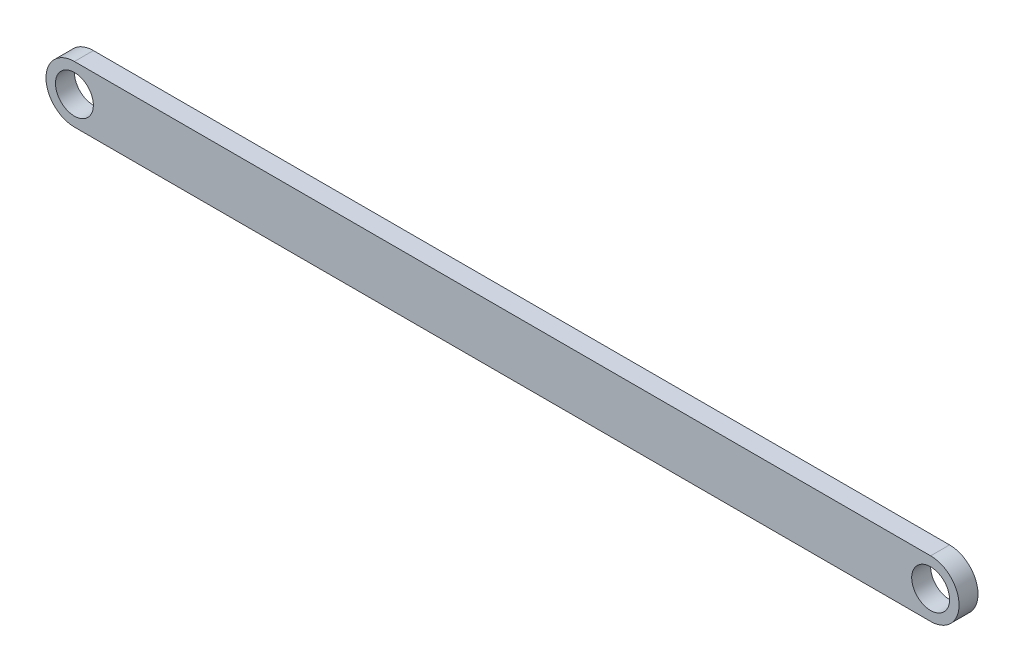
ISO-10303-21;
HEADER;
FILE_DESCRIPTION(('STEP AP214'),'2;1');
FILE_NAME('part.step','',(''),(''),'','','');
FILE_SCHEMA(('AUTOMOTIVE_DESIGN { 1 0 10303 214 1 1 1 1 }'));
ENDSEC;
DATA;
#1=APPLICATION_CONTEXT('core data for automotive mechanical design processes');
#2=APPLICATION_PROTOCOL_DEFINITION('international standard','automotive_design',2000,#1);
#3=PRODUCT_CONTEXT('',#1,'mechanical');
#4=PRODUCT('Part','Part','',(#3));
#5=PRODUCT_RELATED_PRODUCT_CATEGORY('part','',(#4));
#6=PRODUCT_DEFINITION_FORMATION('','',#4);
#7=PRODUCT_DEFINITION_CONTEXT('part definition',#1,'design');
#8=PRODUCT_DEFINITION('design','',#6,#7);
#9=PRODUCT_DEFINITION_SHAPE('','',#8);
#10=(LENGTH_UNIT() NAMED_UNIT(*) SI_UNIT(.MILLI.,.METRE.));
#11=(NAMED_UNIT(*) PLANE_ANGLE_UNIT() SI_UNIT($,.RADIAN.));
#12=(NAMED_UNIT(*) SI_UNIT($,.STERADIAN.) SOLID_ANGLE_UNIT());
#13=UNCERTAINTY_MEASURE_WITH_UNIT(LENGTH_MEASURE(1.E-05),#10,'distance_accuracy_value','');
#14=(GEOMETRIC_REPRESENTATION_CONTEXT(3) GLOBAL_UNCERTAINTY_ASSIGNED_CONTEXT((#13)) GLOBAL_UNIT_ASSIGNED_CONTEXT((#10,
#11,#12)) REPRESENTATION_CONTEXT('',''));
#15=CARTESIAN_POINT('',(0.,0.,0.));
#16=DIRECTION('',(0.,0.,1.));
#17=DIRECTION('',(1.,0.,0.));
#18=AXIS2_PLACEMENT_3D('',#15,#16,#17);
#19=CARTESIAN_POINT('',(0.,0.,5.));
#20=DIRECTION('',(0.,0.,1.));
#21=DIRECTION('',(1.,0.,0.));
#22=AXIS2_PLACEMENT_3D('',#19,#20,#21);
#23=PLANE('',#22);
#24=CARTESIAN_POINT('',(-87.7010278622485,7.49999999999998,5.));
#25=DIRECTION('',(0.,0.,1.));
#26=DIRECTION('',(1.,0.,0.));
#27=AXIS2_PLACEMENT_3D('',#24,#25,#26);
#28=CIRCLE('',#27,5.);
#29=CARTESIAN_POINT('',(-82.7010278622485,7.49999999999998,5.));
#30=VERTEX_POINT('',#29);
#31=EDGE_CURVE('E176',#30,#30,#28,.T.);
#32=ORIENTED_EDGE('',*,*,#31,.F.);
#33=EDGE_LOOP('',(#32));
#34=FACE_BOUND('',#33,.T.);
#35=CARTESIAN_POINT('',(138.298972137752,7.50000000000003,5.));
#36=DIRECTION('',(0.,0.,1.));
#37=DIRECTION('',(1.,0.,0.));
#38=AXIS2_PLACEMENT_3D('',#35,#36,#37);
#39=CIRCLE('',#38,5.00000000000002);
#40=CARTESIAN_POINT('',(143.298972137752,7.50000000000003,5.));
#41=VERTEX_POINT('',#40);
#42=EDGE_CURVE('E181',#41,#41,#39,.F.);
#43=ORIENTED_EDGE('',*,*,#42,.T.);
#44=EDGE_LOOP('',(#43));
#45=FACE_BOUND('',#44,.T.);
#46=DIRECTION('',(1.,0.,0.));
#47=VECTOR('',#46,1.);
#48=CARTESIAN_POINT('',(-95.2010278622485,0.,5.));
#49=LINE('',#48,#47);
#50=CARTESIAN_POINT('',(-87.7010278622485,0.,5.));
#51=VERTEX_POINT('',#50);
#52=CARTESIAN_POINT('',(138.298972137752,0.,5.));
#53=VERTEX_POINT('',#52);
#54=EDGE_CURVE('E115',#51,#53,#49,.T.);
#55=ORIENTED_EDGE('',*,*,#54,.T.);
#56=CARTESIAN_POINT('',(138.298972137752,7.50000000000003,5.));
#57=DIRECTION('',(0.,0.,1.));
#58=DIRECTION('',(1.,0.,0.));
#59=AXIS2_PLACEMENT_3D('',#56,#57,#58);
#60=CIRCLE('',#59,7.49999999999998);
#61=CARTESIAN_POINT('',(138.298972137752,15.,5.));
#62=VERTEX_POINT('',#61);
#63=EDGE_CURVE('E160',#62,#53,#60,.F.);
#64=ORIENTED_EDGE('',*,*,#63,.F.);
#65=DIRECTION('',(-1.,0.,0.));
#66=VECTOR('',#65,1.);
#67=CARTESIAN_POINT('',(145.798972137751,15.,5.));
#68=LINE('',#67,#66);
#69=CARTESIAN_POINT('',(-87.7010278622485,15.,5.));
#70=VERTEX_POINT('',#69);
#71=EDGE_CURVE('E12',#62,#70,#68,.T.);
#72=ORIENTED_EDGE('',*,*,#71,.T.);
#73=CARTESIAN_POINT('',(-87.7010278622485,7.49999999999998,5.));
#74=DIRECTION('',(0.,0.,1.));
#75=DIRECTION('',(1.,0.,0.));
#76=AXIS2_PLACEMENT_3D('',#73,#74,#75);
#77=CIRCLE('',#76,7.5);
#78=EDGE_CURVE('E129',#70,#51,#77,.T.);
#79=ORIENTED_EDGE('',*,*,#78,.T.);
#80=EDGE_LOOP('',(#55,#64,#72,#79));
#81=FACE_BOUND('',#80,.T.);
#82=ADVANCED_FACE('F105',(#34,#45,#81),#23,.T.);
#83=CARTESIAN_POINT('',(0.,0.,0.));
#84=DIRECTION('',(0.,0.,1.));
#85=DIRECTION('',(1.,0.,0.));
#86=AXIS2_PLACEMENT_3D('',#83,#84,#85);
#87=PLANE('',#86);
#88=CARTESIAN_POINT('',(-87.7010278622485,7.49999999999998,0.));
#89=DIRECTION('',(0.,0.,1.));
#90=DIRECTION('',(1.,0.,0.));
#91=AXIS2_PLACEMENT_3D('',#88,#89,#90);
#92=CIRCLE('',#91,5.);
#93=CARTESIAN_POINT('',(-82.7010278622485,7.49999999999998,0.));
#94=VERTEX_POINT('',#93);
#95=EDGE_CURVE('E172',#94,#94,#92,.T.);
#96=ORIENTED_EDGE('',*,*,#95,.T.);
#97=EDGE_LOOP('',(#96));
#98=FACE_BOUND('',#97,.T.);
#99=CARTESIAN_POINT('',(138.298972137752,7.50000000000003,0.));
#100=DIRECTION('',(0.,0.,1.));
#101=DIRECTION('',(1.,0.,0.));
#102=AXIS2_PLACEMENT_3D('',#99,#100,#101);
#103=CIRCLE('',#102,5.00000000000002);
#104=CARTESIAN_POINT('',(143.298972137752,7.50000000000003,0.));
#105=VERTEX_POINT('',#104);
#106=EDGE_CURVE('E185',#105,#105,#103,.F.);
#107=ORIENTED_EDGE('',*,*,#106,.F.);
#108=EDGE_LOOP('',(#107));
#109=FACE_BOUND('',#108,.T.);
#110=CARTESIAN_POINT('',(138.298972137752,7.50000000000003,0.));
#111=DIRECTION('',(0.,0.,1.));
#112=DIRECTION('',(1.,0.,0.));
#113=AXIS2_PLACEMENT_3D('',#110,#111,#112);
#114=CIRCLE('',#113,7.49999999999998);
#115=CARTESIAN_POINT('',(138.298972137752,15.,0.));
#116=VERTEX_POINT('',#115);
#117=CARTESIAN_POINT('',(138.298972137752,0.,0.));
#118=VERTEX_POINT('',#117);
#119=EDGE_CURVE('E153',#116,#118,#114,.F.);
#120=ORIENTED_EDGE('',*,*,#119,.T.);
#121=DIRECTION('',(1.,0.,0.));
#122=VECTOR('',#121,1.);
#123=CARTESIAN_POINT('',(-95.2010278622485,0.,0.));
#124=LINE('',#123,#122);
#125=CARTESIAN_POINT('',(-87.7010278622485,0.,0.));
#126=VERTEX_POINT('',#125);
#127=EDGE_CURVE('E157',#126,#118,#124,.T.);
#128=ORIENTED_EDGE('',*,*,#127,.F.);
#129=CARTESIAN_POINT('',(-87.7010278622485,7.49999999999998,0.));
#130=DIRECTION('',(0.,0.,1.));
#131=DIRECTION('',(1.,0.,0.));
#132=AXIS2_PLACEMENT_3D('',#129,#130,#131);
#133=CIRCLE('',#132,7.5);
#134=CARTESIAN_POINT('',(-87.7010278622485,15.,0.));
#135=VERTEX_POINT('',#134);
#136=EDGE_CURVE('E143',#135,#126,#133,.T.);
#137=ORIENTED_EDGE('',*,*,#136,.F.);
#138=DIRECTION('',(-1.,0.,0.));
#139=VECTOR('',#138,1.);
#140=CARTESIAN_POINT('',(145.798972137751,15.,0.));
#141=LINE('',#140,#139);
#142=EDGE_CURVE('E109',#116,#135,#141,.T.);
#143=ORIENTED_EDGE('',*,*,#142,.F.);
#144=EDGE_LOOP('',(#120,#128,#137,#143));
#145=FACE_BOUND('',#144,.T.);
#146=ADVANCED_FACE('F155',(#98,#109,#145),#87,.F.);
#147=CARTESIAN_POINT('',(-95.2010278622485,0.,5.));
#148=DIRECTION('',(0.,1.,0.));
#149=DIRECTION('',(0.,0.,1.));
#150=AXIS2_PLACEMENT_3D('',#147,#148,#149);
#151=PLANE('',#150);
#152=DIRECTION('',(0.,0.,1.));
#153=VECTOR('',#152,1.);
#154=CARTESIAN_POINT('',(138.298972137752,0.,0.));
#155=LINE('',#154,#153);
#156=EDGE_CURVE('E163',#118,#53,#155,.T.);
#157=ORIENTED_EDGE('',*,*,#156,.T.);
#158=ORIENTED_EDGE('',*,*,#54,.F.);
#159=DIRECTION('',(0.,0.,1.));
#160=VECTOR('',#159,1.);
#161=CARTESIAN_POINT('',(-87.7010278622485,0.,0.));
#162=LINE('',#161,#160);
#163=EDGE_CURVE('E169',#126,#51,#162,.T.);
#164=ORIENTED_EDGE('',*,*,#163,.F.);
#165=ORIENTED_EDGE('',*,*,#127,.T.);
#166=EDGE_LOOP('',(#157,#158,#164,#165));
#167=FACE_BOUND('',#166,.T.);
#168=ADVANCED_FACE('F107',(#167),#151,.F.);
#169=CARTESIAN_POINT('',(145.798972137751,15.,5.));
#170=DIRECTION('',(0.,-1.,0.));
#171=DIRECTION('',(1.,0.,0.));
#172=AXIS2_PLACEMENT_3D('',#169,#170,#171);
#173=PLANE('',#172);
#174=ORIENTED_EDGE('',*,*,#142,.T.);
#175=DIRECTION('',(0.,0.,1.));
#176=VECTOR('',#175,1.);
#177=CARTESIAN_POINT('',(-87.7010278622485,15.,0.));
#178=LINE('',#177,#176);
#179=EDGE_CURVE('E123',#135,#70,#178,.T.);
#180=ORIENTED_EDGE('',*,*,#179,.T.);
#181=ORIENTED_EDGE('',*,*,#71,.F.);
#182=DIRECTION('',(0.,0.,1.));
#183=VECTOR('',#182,1.);
#184=CARTESIAN_POINT('',(138.298972137752,15.,0.));
#185=LINE('',#184,#183);
#186=EDGE_CURVE('E141',#116,#62,#185,.T.);
#187=ORIENTED_EDGE('',*,*,#186,.F.);
#188=EDGE_LOOP('',(#174,#180,#181,#187));
#189=FACE_BOUND('',#188,.T.);
#190=ADVANCED_FACE('F207',(#189),#173,.F.);
#191=CARTESIAN_POINT('',(138.298972137752,7.50000000000003,0.));
#192=DIRECTION('',(0.,0.,1.));
#193=DIRECTION('',(1.,0.,0.));
#194=AXIS2_PLACEMENT_3D('',#191,#192,#193);
#195=CYLINDRICAL_SURFACE('',#194,5.00000000000002);
#196=ORIENTED_EDGE('',*,*,#106,.T.);
#197=EDGE_LOOP('',(#196));
#198=FACE_BOUND('',#197,.T.);
#199=ORIENTED_EDGE('',*,*,#42,.F.);
#200=EDGE_LOOP('',(#199));
#201=FACE_BOUND('',#200,.T.);
#202=ADVANCED_FACE('F209',(#198,#201),#195,.F.);
#203=CARTESIAN_POINT('',(138.298972137752,7.50000000000003,0.));
#204=DIRECTION('',(0.,0.,1.));
#205=DIRECTION('',(1.,0.,0.));
#206=AXIS2_PLACEMENT_3D('',#203,#204,#205);
#207=CYLINDRICAL_SURFACE('',#206,7.49999999999998);
#208=ORIENTED_EDGE('',*,*,#63,.T.);
#209=ORIENTED_EDGE('',*,*,#156,.F.);
#210=ORIENTED_EDGE('',*,*,#119,.F.);
#211=ORIENTED_EDGE('',*,*,#186,.T.);
#212=EDGE_LOOP('',(#208,#209,#210,#211));
#213=FACE_BOUND('',#212,.T.);
#214=ADVANCED_FACE('F164',(#213),#207,.T.);
#215=CARTESIAN_POINT('',(-87.7010278622485,7.49999999999998,0.));
#216=DIRECTION('',(0.,0.,1.));
#217=DIRECTION('',(1.,0.,0.));
#218=AXIS2_PLACEMENT_3D('',#215,#216,#217);
#219=CYLINDRICAL_SURFACE('',#218,5.);
#220=ORIENTED_EDGE('',*,*,#95,.F.);
#221=EDGE_LOOP('',(#220));
#222=FACE_BOUND('',#221,.T.);
#223=ORIENTED_EDGE('',*,*,#31,.T.);
#224=EDGE_LOOP('',(#223));
#225=FACE_BOUND('',#224,.T.);
#226=ADVANCED_FACE('F229',(#222,#225),#219,.F.);
#227=CARTESIAN_POINT('',(-87.7010278622485,7.49999999999998,0.));
#228=DIRECTION('',(0.,0.,1.));
#229=DIRECTION('',(1.,0.,0.));
#230=AXIS2_PLACEMENT_3D('',#227,#228,#229);
#231=CYLINDRICAL_SURFACE('',#230,7.5);
#232=ORIENTED_EDGE('',*,*,#78,.F.);
#233=ORIENTED_EDGE('',*,*,#179,.F.);
#234=ORIENTED_EDGE('',*,*,#136,.T.);
#235=ORIENTED_EDGE('',*,*,#163,.T.);
#236=EDGE_LOOP('',(#232,#233,#234,#235));
#237=FACE_BOUND('',#236,.T.);
#238=ADVANCED_FACE('F203',(#237),#231,.T.);
#239=CLOSED_SHELL('',(#82,#146,#168,#190,#202,#214,#226,#238));
#240=MANIFOLD_SOLID_BREP('B2',#239);
#241=ADVANCED_BREP_SHAPE_REPRESENTATION('',(#18,#240),#14);
#242=SHAPE_DEFINITION_REPRESENTATION(#9,#241);
ENDSEC;
END-ISO-10303-21;
